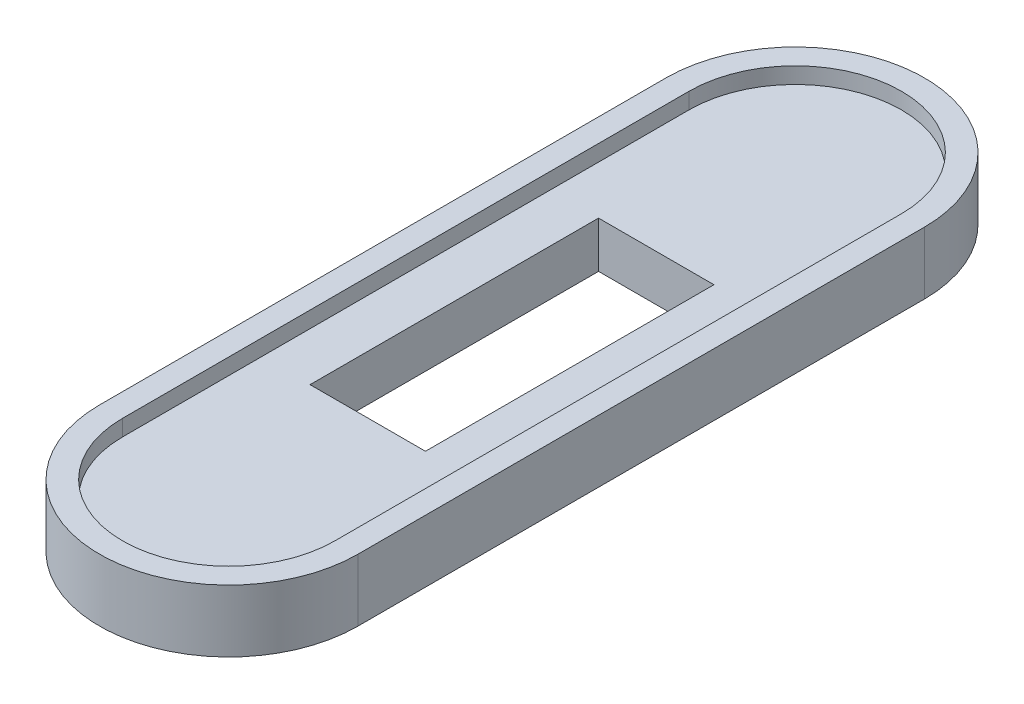
ISO-10303-21;
HEADER;
FILE_DESCRIPTION(('STEP AP214'),'2;1');
FILE_NAME('part.step','',(''),(''),'','','');
FILE_SCHEMA(('AUTOMOTIVE_DESIGN { 1 0 10303 214 1 1 1 1 }'));
ENDSEC;
DATA;
#1=APPLICATION_CONTEXT('core data for automotive mechanical design processes');
#2=APPLICATION_PROTOCOL_DEFINITION('international standard','automotive_design',2000,#1);
#3=PRODUCT_CONTEXT('',#1,'mechanical');
#4=PRODUCT('Part','Part','',(#3));
#5=PRODUCT_RELATED_PRODUCT_CATEGORY('part','',(#4));
#6=PRODUCT_DEFINITION_FORMATION('','',#4);
#7=PRODUCT_DEFINITION_CONTEXT('part definition',#1,'design');
#8=PRODUCT_DEFINITION('design','',#6,#7);
#9=PRODUCT_DEFINITION_SHAPE('','',#8);
#10=(LENGTH_UNIT() NAMED_UNIT(*) SI_UNIT(.MILLI.,.METRE.));
#11=(NAMED_UNIT(*) PLANE_ANGLE_UNIT() SI_UNIT($,.RADIAN.));
#12=(NAMED_UNIT(*) SI_UNIT($,.STERADIAN.) SOLID_ANGLE_UNIT());
#13=UNCERTAINTY_MEASURE_WITH_UNIT(LENGTH_MEASURE(1.E-05),#10,'distance_accuracy_value','');
#14=(GEOMETRIC_REPRESENTATION_CONTEXT(3) GLOBAL_UNCERTAINTY_ASSIGNED_CONTEXT((#13)) GLOBAL_UNIT_ASSIGNED_CONTEXT((#10,
#11,#12)) REPRESENTATION_CONTEXT('',''));
#15=CARTESIAN_POINT('',(0.,0.,0.));
#16=DIRECTION('',(0.,0.,1.));
#17=DIRECTION('',(1.,0.,0.));
#18=AXIS2_PLACEMENT_3D('',#15,#16,#17);
#19=CARTESIAN_POINT('',(9.2,1.4,0.));
#20=DIRECTION('',(0.,1.,0.));
#21=DIRECTION('',(0.,0.,1.));
#22=AXIS2_PLACEMENT_3D('',#19,#20,#21);
#23=PLANE('',#22);
#24=CARTESIAN_POINT('',(9.2,1.4,0.));
#25=DIRECTION('',(0.,1.,0.));
#26=DIRECTION('',(1.,0.,0.));
#27=AXIS2_PLACEMENT_3D('',#24,#25,#26);
#28=CIRCLE('',#27,11.2);
#29=CARTESIAN_POINT('',(-2.,1.4,0.));
#30=VERTEX_POINT('',#29);
#31=CARTESIAN_POINT('',(20.4,1.4,0.));
#32=VERTEX_POINT('',#31);
#33=EDGE_CURVE('E230',#30,#32,#28,.T.);
#34=ORIENTED_EDGE('',*,*,#33,.T.);
#35=DIRECTION('',(0.,0.,-1.));
#36=VECTOR('',#35,1.);
#37=CARTESIAN_POINT('',(20.4,1.4,0.));
#38=LINE('',#37,#36);
#39=CARTESIAN_POINT('',(20.4,1.4,-49.1));
#40=VERTEX_POINT('',#39);
#41=EDGE_CURVE('E232',#32,#40,#38,.T.);
#42=ORIENTED_EDGE('',*,*,#41,.T.);
#43=CARTESIAN_POINT('',(9.2,1.4,-49.1));
#44=DIRECTION('',(0.,1.,0.));
#45=DIRECTION('',(1.,0.,0.));
#46=AXIS2_PLACEMENT_3D('',#43,#44,#45);
#47=CIRCLE('',#46,11.2);
#48=CARTESIAN_POINT('',(-2.,1.4,-49.1));
#49=VERTEX_POINT('',#48);
#50=EDGE_CURVE('E234',#40,#49,#47,.T.);
#51=ORIENTED_EDGE('',*,*,#50,.T.);
#52=DIRECTION('',(0.,0.,1.));
#53=VECTOR('',#52,1.);
#54=CARTESIAN_POINT('',(-2.,1.4,0.));
#55=LINE('',#54,#53);
#56=EDGE_CURVE('E82',#49,#30,#55,.T.);
#57=ORIENTED_EDGE('',*,*,#56,.T.);
#58=EDGE_LOOP('',(#34,#42,#51,#57));
#59=FACE_BOUND('',#58,.T.);
#60=DIRECTION('',(0.,0.,-1.));
#61=VECTOR('',#60,1.);
#62=CARTESIAN_POINT('',(18.4,1.4,0.));
#63=LINE('',#62,#61);
#64=CARTESIAN_POINT('',(18.4,1.4,0.));
#65=VERTEX_POINT('',#64);
#66=CARTESIAN_POINT('',(18.4,1.4,-49.1));
#67=VERTEX_POINT('',#66);
#68=EDGE_CURVE('E205',#65,#67,#63,.T.);
#69=ORIENTED_EDGE('',*,*,#68,.F.);
#70=CARTESIAN_POINT('',(9.2,1.4,0.));
#71=DIRECTION('',(0.,1.,0.));
#72=DIRECTION('',(0.,0.,1.));
#73=AXIS2_PLACEMENT_3D('',#70,#71,#72);
#74=CIRCLE('',#73,9.2);
#75=CARTESIAN_POINT('',(0.,1.4,0.));
#76=VERTEX_POINT('',#75);
#77=EDGE_CURVE('E203',#76,#65,#74,.T.);
#78=ORIENTED_EDGE('',*,*,#77,.F.);
#79=DIRECTION('',(0.,0.,1.));
#80=VECTOR('',#79,1.);
#81=CARTESIAN_POINT('',(0.,1.4,0.));
#82=LINE('',#81,#80);
#83=CARTESIAN_POINT('',(0.,1.4,-49.1));
#84=VERTEX_POINT('',#83);
#85=EDGE_CURVE('E210',#84,#76,#82,.T.);
#86=ORIENTED_EDGE('',*,*,#85,.F.);
#87=CARTESIAN_POINT('',(9.2,1.4,-49.1));
#88=DIRECTION('',(0.,1.,0.));
#89=DIRECTION('',(0.,0.,-1.));
#90=AXIS2_PLACEMENT_3D('',#87,#88,#89);
#91=CIRCLE('',#90,9.2);
#92=EDGE_CURVE('E208',#67,#84,#91,.T.);
#93=ORIENTED_EDGE('',*,*,#92,.F.);
#94=EDGE_LOOP('',(#69,#78,#86,#93));
#95=FACE_BOUND('',#94,.T.);
#96=ADVANCED_FACE('F59',(#59,#95),#23,.T.);
#97=CARTESIAN_POINT('',(9.2,1.4,0.));
#98=DIRECTION('',(0.,-1.,0.));
#99=DIRECTION('',(0.,0.,-1.));
#100=AXIS2_PLACEMENT_3D('',#97,#98,#99);
#101=CYLINDRICAL_SURFACE('',#100,11.2);
#102=DIRECTION('',(0.,-1.,0.));
#103=VECTOR('',#102,1.);
#104=CARTESIAN_POINT('',(-2.,1.4,0.));
#105=LINE('',#104,#103);
#106=CARTESIAN_POINT('',(-2.,-4.,0.));
#107=VERTEX_POINT('',#106);
#108=EDGE_CURVE('E237',#30,#107,#105,.T.);
#109=ORIENTED_EDGE('',*,*,#108,.T.);
#110=CARTESIAN_POINT('',(9.2,-4.,0.));
#111=DIRECTION('',(0.,-1.,0.));
#112=DIRECTION('',(0.,0.,-1.));
#113=AXIS2_PLACEMENT_3D('',#110,#111,#112);
#114=CIRCLE('',#113,11.2);
#115=CARTESIAN_POINT('',(20.4,-4.,0.));
#116=VERTEX_POINT('',#115);
#117=EDGE_CURVE('E167',#116,#107,#114,.T.);
#118=ORIENTED_EDGE('',*,*,#117,.F.);
#119=DIRECTION('',(0.,-1.,0.));
#120=VECTOR('',#119,1.);
#121=CARTESIAN_POINT('',(20.4,1.4,0.));
#122=LINE('',#121,#120);
#123=EDGE_CURVE('E12',#32,#116,#122,.T.);
#124=ORIENTED_EDGE('',*,*,#123,.F.);
#125=ORIENTED_EDGE('',*,*,#33,.F.);
#126=EDGE_LOOP('',(#109,#118,#124,#125));
#127=FACE_BOUND('',#126,.T.);
#128=ADVANCED_FACE('F61',(#127),#101,.T.);
#129=CARTESIAN_POINT('',(20.4,1.4,0.));
#130=DIRECTION('',(-1.,0.,0.));
#131=DIRECTION('',(0.,0.,1.));
#132=AXIS2_PLACEMENT_3D('',#129,#130,#131);
#133=PLANE('',#132);
#134=ORIENTED_EDGE('',*,*,#123,.T.);
#135=DIRECTION('',(0.,0.,1.));
#136=VECTOR('',#135,1.);
#137=CARTESIAN_POINT('',(20.4,-4.,-49.1));
#138=LINE('',#137,#136);
#139=CARTESIAN_POINT('',(20.4,-4.,-49.1));
#140=VERTEX_POINT('',#139);
#141=EDGE_CURVE('E199',#140,#116,#138,.T.);
#142=ORIENTED_EDGE('',*,*,#141,.F.);
#143=DIRECTION('',(0.,-1.,0.));
#144=VECTOR('',#143,1.);
#145=CARTESIAN_POINT('',(20.4,1.4,-49.1));
#146=LINE('',#145,#144);
#147=EDGE_CURVE('E67',#40,#140,#146,.T.);
#148=ORIENTED_EDGE('',*,*,#147,.F.);
#149=ORIENTED_EDGE('',*,*,#41,.F.);
#150=EDGE_LOOP('',(#134,#142,#148,#149));
#151=FACE_BOUND('',#150,.T.);
#152=ADVANCED_FACE('F251',(#151),#133,.F.);
#153=CARTESIAN_POINT('',(9.2,1.4,-49.1));
#154=DIRECTION('',(0.,-1.,0.));
#155=DIRECTION('',(0.,0.,-1.));
#156=AXIS2_PLACEMENT_3D('',#153,#154,#155);
#157=CYLINDRICAL_SURFACE('',#156,11.2);
#158=ORIENTED_EDGE('',*,*,#147,.T.);
#159=CARTESIAN_POINT('',(9.2,-4.,-49.1));
#160=DIRECTION('',(0.,-1.,0.));
#161=DIRECTION('',(0.,0.,-1.));
#162=AXIS2_PLACEMENT_3D('',#159,#160,#161);
#163=CIRCLE('',#162,11.2);
#164=CARTESIAN_POINT('',(-2.,-4.,-49.1));
#165=VERTEX_POINT('',#164);
#166=EDGE_CURVE('E196',#165,#140,#163,.T.);
#167=ORIENTED_EDGE('',*,*,#166,.F.);
#168=DIRECTION('',(0.,-1.,0.));
#169=VECTOR('',#168,1.);
#170=CARTESIAN_POINT('',(-2.,1.4,-49.1));
#171=LINE('',#170,#169);
#172=EDGE_CURVE('E239',#49,#165,#171,.T.);
#173=ORIENTED_EDGE('',*,*,#172,.F.);
#174=ORIENTED_EDGE('',*,*,#50,.F.);
#175=EDGE_LOOP('',(#158,#167,#173,#174));
#176=FACE_BOUND('',#175,.T.);
#177=ADVANCED_FACE('F244',(#176),#157,.T.);
#178=CARTESIAN_POINT('',(-2.,1.4,0.));
#179=DIRECTION('',(1.,0.,0.));
#180=DIRECTION('',(0.,0.,-1.));
#181=AXIS2_PLACEMENT_3D('',#178,#179,#180);
#182=PLANE('',#181);
#183=ORIENTED_EDGE('',*,*,#172,.T.);
#184=DIRECTION('',(0.,0.,-1.));
#185=VECTOR('',#184,1.);
#186=CARTESIAN_POINT('',(-2.,-4.,0.));
#187=LINE('',#186,#185);
#188=EDGE_CURVE('E193',#107,#165,#187,.T.);
#189=ORIENTED_EDGE('',*,*,#188,.F.);
#190=ORIENTED_EDGE('',*,*,#108,.F.);
#191=ORIENTED_EDGE('',*,*,#56,.F.);
#192=EDGE_LOOP('',(#183,#189,#190,#191));
#193=FACE_BOUND('',#192,.T.);
#194=ADVANCED_FACE('F256',(#193),#182,.F.);
#195=CARTESIAN_POINT('',(9.2,1.4,0.));
#196=DIRECTION('',(0.,-1.,0.));
#197=DIRECTION('',(0.,0.,-1.));
#198=AXIS2_PLACEMENT_3D('',#195,#196,#197);
#199=CYLINDRICAL_SURFACE('',#198,9.2);
#200=CARTESIAN_POINT('',(9.2,0.,0.));
#201=DIRECTION('',(0.,1.,0.));
#202=DIRECTION('',(0.,0.,1.));
#203=AXIS2_PLACEMENT_3D('',#200,#201,#202);
#204=CIRCLE('',#203,9.2);
#205=CARTESIAN_POINT('',(0.,0.,0.));
#206=VERTEX_POINT('',#205);
#207=CARTESIAN_POINT('',(18.4,0.,0.));
#208=VERTEX_POINT('',#207);
#209=EDGE_CURVE('E202',#206,#208,#204,.T.);
#210=ORIENTED_EDGE('',*,*,#209,.F.);
#211=DIRECTION('',(0.,-1.,0.));
#212=VECTOR('',#211,1.);
#213=CARTESIAN_POINT('',(0.,1.4,0.));
#214=LINE('',#213,#212);
#215=EDGE_CURVE('E212',#76,#206,#214,.T.);
#216=ORIENTED_EDGE('',*,*,#215,.F.);
#217=ORIENTED_EDGE('',*,*,#77,.T.);
#218=DIRECTION('',(0.,-1.,0.));
#219=VECTOR('',#218,1.);
#220=CARTESIAN_POINT('',(18.4,1.4,0.));
#221=LINE('',#220,#219);
#222=EDGE_CURVE('E227',#65,#208,#221,.T.);
#223=ORIENTED_EDGE('',*,*,#222,.T.);
#224=EDGE_LOOP('',(#210,#216,#217,#223));
#225=FACE_BOUND('',#224,.T.);
#226=ADVANCED_FACE('F258',(#225),#199,.F.);
#227=CARTESIAN_POINT('',(18.4,1.4,0.));
#228=DIRECTION('',(-1.,0.,0.));
#229=DIRECTION('',(0.,0.,1.));
#230=AXIS2_PLACEMENT_3D('',#227,#228,#229);
#231=PLANE('',#230);
#232=DIRECTION('',(0.,0.,-1.));
#233=VECTOR('',#232,1.);
#234=CARTESIAN_POINT('',(18.4,0.,0.));
#235=LINE('',#234,#233);
#236=CARTESIAN_POINT('',(18.4,0.,-49.1));
#237=VERTEX_POINT('',#236);
#238=EDGE_CURVE('E215',#208,#237,#235,.T.);
#239=ORIENTED_EDGE('',*,*,#238,.F.);
#240=ORIENTED_EDGE('',*,*,#222,.F.);
#241=ORIENTED_EDGE('',*,*,#68,.T.);
#242=DIRECTION('',(0.,-1.,0.));
#243=VECTOR('',#242,1.);
#244=CARTESIAN_POINT('',(18.4,1.4,-49.1));
#245=LINE('',#244,#243);
#246=EDGE_CURVE('E225',#67,#237,#245,.T.);
#247=ORIENTED_EDGE('',*,*,#246,.T.);
#248=EDGE_LOOP('',(#239,#240,#241,#247));
#249=FACE_BOUND('',#248,.T.);
#250=ADVANCED_FACE('F264',(#249),#231,.T.);
#251=CARTESIAN_POINT('',(9.2,1.4,-49.1));
#252=DIRECTION('',(0.,-1.,0.));
#253=DIRECTION('',(0.,0.,-1.));
#254=AXIS2_PLACEMENT_3D('',#251,#252,#253);
#255=CYLINDRICAL_SURFACE('',#254,9.2);
#256=CARTESIAN_POINT('',(9.2,0.,-49.1));
#257=DIRECTION('',(0.,1.,0.));
#258=DIRECTION('',(0.,0.,-1.));
#259=AXIS2_PLACEMENT_3D('',#256,#257,#258);
#260=CIRCLE('',#259,9.2);
#261=CARTESIAN_POINT('',(0.,0.,-49.1));
#262=VERTEX_POINT('',#261);
#263=EDGE_CURVE('E218',#237,#262,#260,.T.);
#264=ORIENTED_EDGE('',*,*,#263,.F.);
#265=ORIENTED_EDGE('',*,*,#246,.F.);
#266=ORIENTED_EDGE('',*,*,#92,.T.);
#267=DIRECTION('',(0.,-1.,0.));
#268=VECTOR('',#267,1.);
#269=CARTESIAN_POINT('',(0.,1.4,-49.1));
#270=LINE('',#269,#268);
#271=EDGE_CURVE('E74',#84,#262,#270,.T.);
#272=ORIENTED_EDGE('',*,*,#271,.T.);
#273=EDGE_LOOP('',(#264,#265,#266,#272));
#274=FACE_BOUND('',#273,.T.);
#275=ADVANCED_FACE('F277',(#274),#255,.F.);
#276=CARTESIAN_POINT('',(0.,1.4,0.));
#277=DIRECTION('',(1.,0.,0.));
#278=DIRECTION('',(0.,0.,-1.));
#279=AXIS2_PLACEMENT_3D('',#276,#277,#278);
#280=PLANE('',#279);
#281=DIRECTION('',(0.,0.,1.));
#282=VECTOR('',#281,1.);
#283=CARTESIAN_POINT('',(0.,0.,0.));
#284=LINE('',#283,#282);
#285=EDGE_CURVE('E206',#262,#206,#284,.T.);
#286=ORIENTED_EDGE('',*,*,#285,.F.);
#287=ORIENTED_EDGE('',*,*,#271,.F.);
#288=ORIENTED_EDGE('',*,*,#85,.T.);
#289=ORIENTED_EDGE('',*,*,#215,.T.);
#290=EDGE_LOOP('',(#286,#287,#288,#289));
#291=FACE_BOUND('',#290,.T.);
#292=ADVANCED_FACE('F281',(#291),#280,.T.);
#293=CARTESIAN_POINT('',(9.2,-4.,0.));
#294=DIRECTION('',(0.,-1.,0.));
#295=DIRECTION('',(0.,0.,-1.));
#296=AXIS2_PLACEMENT_3D('',#293,#294,#295);
#297=PLANE('',#296);
#298=ORIENTED_EDGE('',*,*,#117,.T.);
#299=ORIENTED_EDGE('',*,*,#188,.T.);
#300=ORIENTED_EDGE('',*,*,#166,.T.);
#301=ORIENTED_EDGE('',*,*,#141,.T.);
#302=EDGE_LOOP('',(#298,#299,#300,#301));
#303=FACE_BOUND('',#302,.T.);
#304=DIRECTION('',(0.,0.,1.));
#305=VECTOR('',#304,1.);
#306=CARTESIAN_POINT('',(14.2,-4.,-37.05));
#307=LINE('',#306,#305);
#308=CARTESIAN_POINT('',(14.2,-4.,-37.05));
#309=VERTEX_POINT('',#308);
#310=CARTESIAN_POINT('',(14.2,-4.,-12.05));
#311=VERTEX_POINT('',#310);
#312=EDGE_CURVE('E159',#309,#311,#307,.T.);
#313=ORIENTED_EDGE('',*,*,#312,.F.);
#314=DIRECTION('',(1.,0.,0.));
#315=VECTOR('',#314,1.);
#316=CARTESIAN_POINT('',(14.2,-4.,-37.05));
#317=LINE('',#316,#315);
#318=CARTESIAN_POINT('',(4.2,-4.,-37.05));
#319=VERTEX_POINT('',#318);
#320=EDGE_CURVE('E149',#319,#309,#317,.T.);
#321=ORIENTED_EDGE('',*,*,#320,.F.);
#322=DIRECTION('',(0.,0.,-1.));
#323=VECTOR('',#322,1.);
#324=CARTESIAN_POINT('',(4.2,-4.,-37.05));
#325=LINE('',#324,#323);
#326=CARTESIAN_POINT('',(4.20000000000001,-4.,-12.05));
#327=VERTEX_POINT('',#326);
#328=EDGE_CURVE('E175',#327,#319,#325,.T.);
#329=ORIENTED_EDGE('',*,*,#328,.F.);
#330=DIRECTION('',(-1.,0.,0.));
#331=VECTOR('',#330,1.);
#332=CARTESIAN_POINT('',(14.2,-4.,-12.05));
#333=LINE('',#332,#331);
#334=EDGE_CURVE('E173',#311,#327,#333,.T.);
#335=ORIENTED_EDGE('',*,*,#334,.F.);
#336=EDGE_LOOP('',(#313,#321,#329,#335));
#337=FACE_BOUND('',#336,.T.);
#338=ADVANCED_FACE('F171',(#303,#337),#297,.T.);
#339=CARTESIAN_POINT('',(9.2,0.,0.));
#340=DIRECTION('',(0.,-1.,0.));
#341=DIRECTION('',(0.,0.,-1.));
#342=AXIS2_PLACEMENT_3D('',#339,#340,#341);
#343=PLANE('',#342);
#344=ORIENTED_EDGE('',*,*,#209,.T.);
#345=ORIENTED_EDGE('',*,*,#238,.T.);
#346=ORIENTED_EDGE('',*,*,#263,.T.);
#347=ORIENTED_EDGE('',*,*,#285,.T.);
#348=EDGE_LOOP('',(#344,#345,#346,#347));
#349=FACE_BOUND('',#348,.T.);
#350=DIRECTION('',(1.,0.,0.));
#351=VECTOR('',#350,1.);
#352=CARTESIAN_POINT('',(14.2,0.,-37.05));
#353=LINE('',#352,#351);
#354=CARTESIAN_POINT('',(4.2,0.,-37.05));
#355=VERTEX_POINT('',#354);
#356=CARTESIAN_POINT('',(14.2,0.,-37.05));
#357=VERTEX_POINT('',#356);
#358=EDGE_CURVE('E179',#355,#357,#353,.T.);
#359=ORIENTED_EDGE('',*,*,#358,.T.);
#360=DIRECTION('',(0.,0.,1.));
#361=VECTOR('',#360,1.);
#362=CARTESIAN_POINT('',(14.2,0.,-37.05));
#363=LINE('',#362,#361);
#364=CARTESIAN_POINT('',(14.2,0.,-12.05));
#365=VERTEX_POINT('',#364);
#366=EDGE_CURVE('E166',#357,#365,#363,.T.);
#367=ORIENTED_EDGE('',*,*,#366,.T.);
#368=DIRECTION('',(-1.,0.,0.));
#369=VECTOR('',#368,1.);
#370=CARTESIAN_POINT('',(14.2,0.,-12.05));
#371=LINE('',#370,#369);
#372=CARTESIAN_POINT('',(4.20000000000001,0.,-12.05));
#373=VERTEX_POINT('',#372);
#374=EDGE_CURVE('E182',#365,#373,#371,.T.);
#375=ORIENTED_EDGE('',*,*,#374,.T.);
#376=DIRECTION('',(0.,0.,-1.));
#377=VECTOR('',#376,1.);
#378=CARTESIAN_POINT('',(4.2,0.,-37.05));
#379=LINE('',#378,#377);
#380=EDGE_CURVE('E160',#373,#355,#379,.T.);
#381=ORIENTED_EDGE('',*,*,#380,.T.);
#382=EDGE_LOOP('',(#359,#367,#375,#381));
#383=FACE_BOUND('',#382,.T.);
#384=ADVANCED_FACE('F285',(#349,#383),#343,.F.);
#385=CARTESIAN_POINT('',(14.2,-4.,-37.05));
#386=DIRECTION('',(0.,0.,1.));
#387=DIRECTION('',(1.,0.,0.));
#388=AXIS2_PLACEMENT_3D('',#385,#386,#387);
#389=PLANE('',#388);
#390=ORIENTED_EDGE('',*,*,#358,.F.);
#391=DIRECTION('',(0.,1.,0.));
#392=VECTOR('',#391,1.);
#393=CARTESIAN_POINT('',(4.2,-4.,-37.05));
#394=LINE('',#393,#392);
#395=EDGE_CURVE('E155',#319,#355,#394,.T.);
#396=ORIENTED_EDGE('',*,*,#395,.F.);
#397=ORIENTED_EDGE('',*,*,#320,.T.);
#398=DIRECTION('',(0.,1.,0.));
#399=VECTOR('',#398,1.);
#400=CARTESIAN_POINT('',(14.2,-4.,-37.05));
#401=LINE('',#400,#399);
#402=EDGE_CURVE('E152',#309,#357,#401,.T.);
#403=ORIENTED_EDGE('',*,*,#402,.T.);
#404=EDGE_LOOP('',(#390,#396,#397,#403));
#405=FACE_BOUND('',#404,.T.);
#406=ADVANCED_FACE('F151',(#405),#389,.T.);
#407=CARTESIAN_POINT('',(14.2,-4.,-37.05));
#408=DIRECTION('',(-1.,0.,0.));
#409=DIRECTION('',(0.,0.,1.));
#410=AXIS2_PLACEMENT_3D('',#407,#408,#409);
#411=PLANE('',#410);
#412=ORIENTED_EDGE('',*,*,#366,.F.);
#413=ORIENTED_EDGE('',*,*,#402,.F.);
#414=ORIENTED_EDGE('',*,*,#312,.T.);
#415=DIRECTION('',(0.,1.,0.));
#416=VECTOR('',#415,1.);
#417=CARTESIAN_POINT('',(14.2,-4.,-12.05));
#418=LINE('',#417,#416);
#419=EDGE_CURVE('E168',#311,#365,#418,.T.);
#420=ORIENTED_EDGE('',*,*,#419,.T.);
#421=EDGE_LOOP('',(#412,#413,#414,#420));
#422=FACE_BOUND('',#421,.T.);
#423=ADVANCED_FACE('F163',(#422),#411,.T.);
#424=CARTESIAN_POINT('',(14.2,-4.,-12.05));
#425=DIRECTION('',(0.,0.,-1.));
#426=DIRECTION('',(-1.,0.,0.));
#427=AXIS2_PLACEMENT_3D('',#424,#425,#426);
#428=PLANE('',#427);
#429=ORIENTED_EDGE('',*,*,#374,.F.);
#430=ORIENTED_EDGE('',*,*,#419,.F.);
#431=ORIENTED_EDGE('',*,*,#334,.T.);
#432=DIRECTION('',(0.,1.,0.));
#433=VECTOR('',#432,1.);
#434=CARTESIAN_POINT('',(4.20000000000001,-4.,-12.05));
#435=LINE('',#434,#433);
#436=EDGE_CURVE('E188',#327,#373,#435,.T.);
#437=ORIENTED_EDGE('',*,*,#436,.T.);
#438=EDGE_LOOP('',(#429,#430,#431,#437));
#439=FACE_BOUND('',#438,.T.);
#440=ADVANCED_FACE('F295',(#439),#428,.T.);
#441=CARTESIAN_POINT('',(4.2,-4.,-37.05));
#442=DIRECTION('',(1.,0.,0.));
#443=DIRECTION('',(0.,0.,-1.));
#444=AXIS2_PLACEMENT_3D('',#441,#442,#443);
#445=PLANE('',#444);
#446=ORIENTED_EDGE('',*,*,#380,.F.);
#447=ORIENTED_EDGE('',*,*,#436,.F.);
#448=ORIENTED_EDGE('',*,*,#328,.T.);
#449=ORIENTED_EDGE('',*,*,#395,.T.);
#450=EDGE_LOOP('',(#446,#447,#448,#449));
#451=FACE_BOUND('',#450,.T.);
#452=ADVANCED_FACE('F298',(#451),#445,.T.);
#453=CLOSED_SHELL('',(#96,#128,#152,#177,#194,#226,#250,#275,#292,#338,#384,#406,#423,#440,#452));
#454=MANIFOLD_SOLID_BREP('B2',#453);
#455=ADVANCED_BREP_SHAPE_REPRESENTATION('',(#18,#454),#14);
#456=SHAPE_DEFINITION_REPRESENTATION(#9,#455);
ENDSEC;
END-ISO-10303-21;
